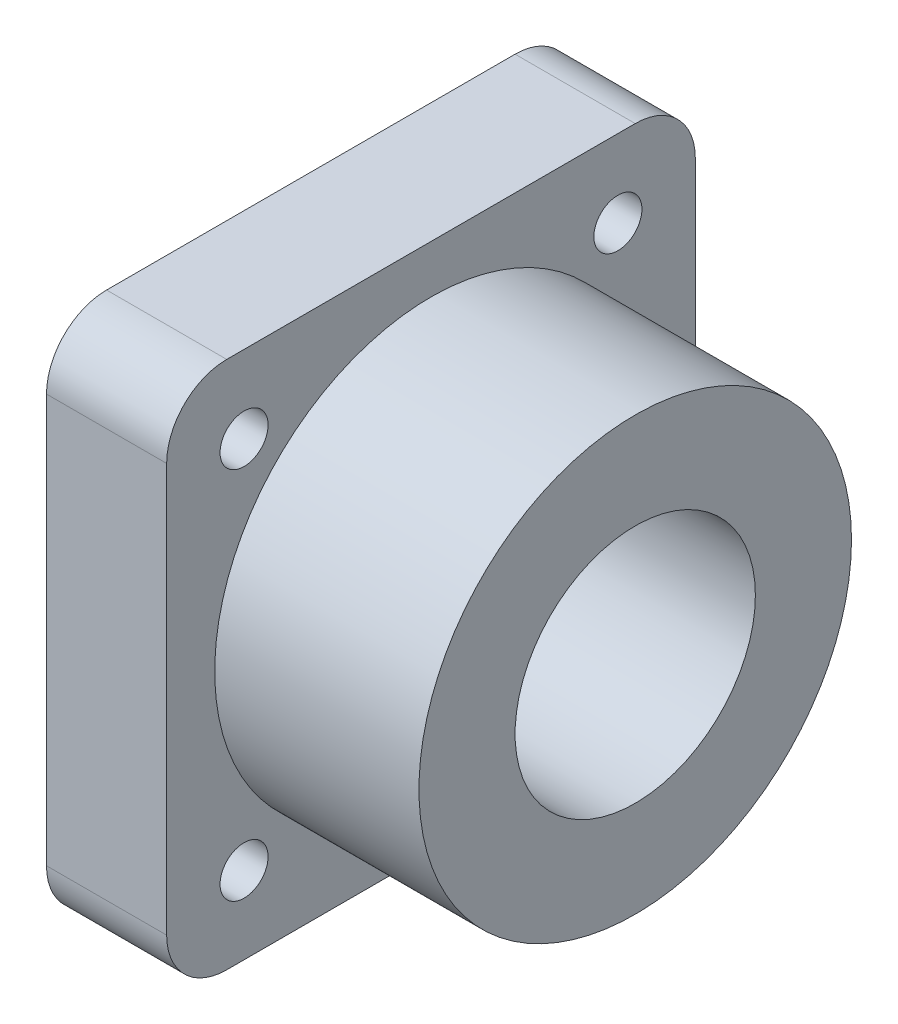
ISO-10303-21;
HEADER;
FILE_DESCRIPTION(('STEP AP214'),'2;1');
FILE_NAME('part.step','',(''),(''),'','','');
FILE_SCHEMA(('AUTOMOTIVE_DESIGN { 1 0 10303 214 1 1 1 1 }'));
ENDSEC;
DATA;
#1=APPLICATION_CONTEXT('core data for automotive mechanical design processes');
#2=APPLICATION_PROTOCOL_DEFINITION('international standard','automotive_design',2000,#1);
#3=PRODUCT_CONTEXT('',#1,'mechanical');
#4=PRODUCT('Part','Part','',(#3));
#5=PRODUCT_RELATED_PRODUCT_CATEGORY('part','',(#4));
#6=PRODUCT_DEFINITION_FORMATION('','',#4);
#7=PRODUCT_DEFINITION_CONTEXT('part definition',#1,'design');
#8=PRODUCT_DEFINITION('design','',#6,#7);
#9=PRODUCT_DEFINITION_SHAPE('','',#8);
#10=(LENGTH_UNIT() NAMED_UNIT(*) SI_UNIT(.MILLI.,.METRE.));
#11=(NAMED_UNIT(*) PLANE_ANGLE_UNIT() SI_UNIT($,.RADIAN.));
#12=(NAMED_UNIT(*) SI_UNIT($,.STERADIAN.) SOLID_ANGLE_UNIT());
#13=UNCERTAINTY_MEASURE_WITH_UNIT(LENGTH_MEASURE(1.E-05),#10,'distance_accuracy_value','');
#14=(GEOMETRIC_REPRESENTATION_CONTEXT(3) GLOBAL_UNCERTAINTY_ASSIGNED_CONTEXT((#13)) GLOBAL_UNIT_ASSIGNED_CONTEXT((#10,
#11,#12)) REPRESENTATION_CONTEXT('',''));
#15=CARTESIAN_POINT('',(0.,0.,0.));
#16=DIRECTION('',(0.,0.,1.));
#17=DIRECTION('',(1.,0.,0.));
#18=AXIS2_PLACEMENT_3D('',#15,#16,#17);
#19=CARTESIAN_POINT('',(10.,0.,0.));
#20=DIRECTION('',(1.,0.,0.));
#21=DIRECTION('',(0.,0.,-1.));
#22=AXIS2_PLACEMENT_3D('',#19,#20,#21);
#23=PLANE('',#22);
#24=CARTESIAN_POINT('',(10.,-15.556349186104,-15.556349186104));
#25=DIRECTION('',(1.,0.,0.));
#26=DIRECTION('',(0.,0.,-1.));
#27=AXIS2_PLACEMENT_3D('',#24,#25,#26);
#28=CIRCLE('',#27,2.);
#29=CARTESIAN_POINT('',(10.,-15.556349186104,-17.556349186104));
#30=VERTEX_POINT('',#29);
#31=EDGE_CURVE('E188',#30,#30,#28,.T.);
#32=ORIENTED_EDGE('',*,*,#31,.F.);
#33=EDGE_LOOP('',(#32));
#34=FACE_BOUND('',#33,.T.);
#35=CARTESIAN_POINT('',(10.,15.556349186104,15.556349186104));
#36=DIRECTION('',(1.,0.,0.));
#37=DIRECTION('',(0.,0.,-1.));
#38=AXIS2_PLACEMENT_3D('',#35,#36,#37);
#39=CIRCLE('',#38,2.);
#40=CARTESIAN_POINT('',(10.,15.556349186104,13.556349186104));
#41=VERTEX_POINT('',#40);
#42=EDGE_CURVE('E129',#41,#41,#39,.T.);
#43=ORIENTED_EDGE('',*,*,#42,.F.);
#44=EDGE_LOOP('',(#43));
#45=FACE_BOUND('',#44,.T.);
#46=DIRECTION('',(0.,0.,1.));
#47=VECTOR('',#46,1.);
#48=CARTESIAN_POINT('',(10.,22.,-22.));
#49=LINE('',#48,#47);
#50=CARTESIAN_POINT('',(10.,22.,-17.));
#51=VERTEX_POINT('',#50);
#52=CARTESIAN_POINT('',(10.,22.,17.));
#53=VERTEX_POINT('',#52);
#54=EDGE_CURVE('E138',#51,#53,#49,.T.);
#55=ORIENTED_EDGE('',*,*,#54,.T.);
#56=CARTESIAN_POINT('',(10.,17.,17.));
#57=DIRECTION('',(1.,0.,0.));
#58=DIRECTION('',(0.,0.,-1.));
#59=AXIS2_PLACEMENT_3D('',#56,#57,#58);
#60=CIRCLE('',#59,5.);
#61=CARTESIAN_POINT('',(10.,17.,22.));
#62=VERTEX_POINT('',#61);
#63=EDGE_CURVE('E157',#53,#62,#60,.T.);
#64=ORIENTED_EDGE('',*,*,#63,.T.);
#65=DIRECTION('',(0.,-1.,0.));
#66=VECTOR('',#65,1.);
#67=CARTESIAN_POINT('',(10.,-22.,22.));
#68=LINE('',#67,#66);
#69=CARTESIAN_POINT('',(10.,-17.,22.));
#70=VERTEX_POINT('',#69);
#71=EDGE_CURVE('E121',#62,#70,#68,.T.);
#72=ORIENTED_EDGE('',*,*,#71,.T.);
#73=CARTESIAN_POINT('',(10.,-17.,17.));
#74=DIRECTION('',(1.,0.,0.));
#75=DIRECTION('',(0.,0.,-1.));
#76=AXIS2_PLACEMENT_3D('',#73,#74,#75);
#77=CIRCLE('',#76,5.);
#78=CARTESIAN_POINT('',(10.,-22.,17.));
#79=VERTEX_POINT('',#78);
#80=EDGE_CURVE('E152',#70,#79,#77,.T.);
#81=ORIENTED_EDGE('',*,*,#80,.T.);
#82=DIRECTION('',(0.,0.,-1.));
#83=VECTOR('',#82,1.);
#84=CARTESIAN_POINT('',(10.,-22.,-22.));
#85=LINE('',#84,#83);
#86=CARTESIAN_POINT('',(10.,-22.,-17.));
#87=VERTEX_POINT('',#86);
#88=EDGE_CURVE('E168',#79,#87,#85,.T.);
#89=ORIENTED_EDGE('',*,*,#88,.T.);
#90=CARTESIAN_POINT('',(10.,-17.,-17.));
#91=DIRECTION('',(1.,0.,0.));
#92=DIRECTION('',(0.,0.,-1.));
#93=AXIS2_PLACEMENT_3D('',#90,#91,#92);
#94=CIRCLE('',#93,5.);
#95=CARTESIAN_POINT('',(10.,-17.,-22.));
#96=VERTEX_POINT('',#95);
#97=EDGE_CURVE('E57',#87,#96,#94,.T.);
#98=ORIENTED_EDGE('',*,*,#97,.T.);
#99=DIRECTION('',(0.,1.,0.));
#100=VECTOR('',#99,1.);
#101=CARTESIAN_POINT('',(10.,-22.,-22.));
#102=LINE('',#101,#100);
#103=CARTESIAN_POINT('',(10.,17.,-22.));
#104=VERTEX_POINT('',#103);
#105=EDGE_CURVE('E176',#96,#104,#102,.T.);
#106=ORIENTED_EDGE('',*,*,#105,.T.);
#107=CARTESIAN_POINT('',(10.,17.,-17.));
#108=DIRECTION('',(1.,0.,0.));
#109=DIRECTION('',(0.,0.,-1.));
#110=AXIS2_PLACEMENT_3D('',#107,#108,#109);
#111=CIRCLE('',#110,5.);
#112=EDGE_CURVE('E155',#104,#51,#111,.T.);
#113=ORIENTED_EDGE('',*,*,#112,.T.);
#114=EDGE_LOOP('',(#55,#64,#72,#81,#89,#98,#106,#113));
#115=FACE_BOUND('',#114,.T.);
#116=CARTESIAN_POINT('',(10.,15.556349186104,-15.556349186104));
#117=DIRECTION('',(1.,0.,0.));
#118=DIRECTION('',(0.,0.,-1.));
#119=AXIS2_PLACEMENT_3D('',#116,#117,#118);
#120=CIRCLE('',#119,2.);
#121=CARTESIAN_POINT('',(10.,15.556349186104,-17.556349186104));
#122=VERTEX_POINT('',#121);
#123=EDGE_CURVE('E183',#122,#122,#120,.T.);
#124=ORIENTED_EDGE('',*,*,#123,.F.);
#125=EDGE_LOOP('',(#124));
#126=FACE_BOUND('',#125,.T.);
#127=CARTESIAN_POINT('',(10.,-15.556349186104,15.556349186104));
#128=DIRECTION('',(1.,0.,0.));
#129=DIRECTION('',(0.,0.,-1.));
#130=AXIS2_PLACEMENT_3D('',#127,#128,#129);
#131=CIRCLE('',#130,2.);
#132=CARTESIAN_POINT('',(10.,-15.556349186104,13.556349186104));
#133=VERTEX_POINT('',#132);
#134=EDGE_CURVE('E194',#133,#133,#131,.T.);
#135=ORIENTED_EDGE('',*,*,#134,.F.);
#136=EDGE_LOOP('',(#135));
#137=FACE_BOUND('',#136,.T.);
#138=CARTESIAN_POINT('',(10.,0.,0.));
#139=DIRECTION('',(1.,0.,0.));
#140=DIRECTION('',(0.,0.,-1.));
#141=AXIS2_PLACEMENT_3D('',#138,#139,#140);
#142=CIRCLE('',#141,18.);
#143=CARTESIAN_POINT('',(10.,0.,-18.));
#144=VERTEX_POINT('',#143);
#145=EDGE_CURVE('E205',#144,#144,#142,.F.);
#146=ORIENTED_EDGE('',*,*,#145,.T.);
#147=EDGE_LOOP('',(#146));
#148=FACE_BOUND('',#147,.T.);
#149=ADVANCED_FACE('F35',(#34,#45,#115,#126,#137,#148),#23,.T.);
#150=CARTESIAN_POINT('',(0.,0.,0.));
#151=DIRECTION('',(1.,0.,0.));
#152=DIRECTION('',(0.,0.,-1.));
#153=AXIS2_PLACEMENT_3D('',#150,#151,#152);
#154=PLANE('',#153);
#155=CARTESIAN_POINT('',(0.,0.,0.));
#156=DIRECTION('',(1.,0.,0.));
#157=DIRECTION('',(0.,0.,-1.));
#158=AXIS2_PLACEMENT_3D('',#155,#156,#157);
#159=CIRCLE('',#158,10.);
#160=CARTESIAN_POINT('',(0.,0.,-10.));
#161=VERTEX_POINT('',#160);
#162=EDGE_CURVE('E200',#161,#161,#159,.T.);
#163=ORIENTED_EDGE('',*,*,#162,.T.);
#164=EDGE_LOOP('',(#163));
#165=FACE_BOUND('',#164,.T.);
#166=CARTESIAN_POINT('',(0.,-15.556349186104,-15.556349186104));
#167=DIRECTION('',(1.,0.,0.));
#168=DIRECTION('',(0.,0.,-1.));
#169=AXIS2_PLACEMENT_3D('',#166,#167,#168);
#170=CIRCLE('',#169,2.);
#171=CARTESIAN_POINT('',(0.,-15.556349186104,-17.556349186104));
#172=VERTEX_POINT('',#171);
#173=EDGE_CURVE('E191',#172,#172,#170,.T.);
#174=ORIENTED_EDGE('',*,*,#173,.T.);
#175=EDGE_LOOP('',(#174));
#176=FACE_BOUND('',#175,.T.);
#177=CARTESIAN_POINT('',(0.,15.556349186104,15.556349186104));
#178=DIRECTION('',(1.,0.,0.));
#179=DIRECTION('',(0.,0.,-1.));
#180=AXIS2_PLACEMENT_3D('',#177,#178,#179);
#181=CIRCLE('',#180,2.);
#182=CARTESIAN_POINT('',(0.,15.556349186104,13.556349186104));
#183=VERTEX_POINT('',#182);
#184=EDGE_CURVE('E135',#183,#183,#181,.T.);
#185=ORIENTED_EDGE('',*,*,#184,.T.);
#186=EDGE_LOOP('',(#185));
#187=FACE_BOUND('',#186,.T.);
#188=DIRECTION('',(0.,-1.,0.));
#189=VECTOR('',#188,1.);
#190=CARTESIAN_POINT('',(0.,-22.,22.));
#191=LINE('',#190,#189);
#192=CARTESIAN_POINT('',(0.,17.,22.));
#193=VERTEX_POINT('',#192);
#194=CARTESIAN_POINT('',(0.,-17.,22.));
#195=VERTEX_POINT('',#194);
#196=EDGE_CURVE('E118',#193,#195,#191,.T.);
#197=ORIENTED_EDGE('',*,*,#196,.F.);
#198=CARTESIAN_POINT('',(0.,17.,17.));
#199=DIRECTION('',(1.,0.,0.));
#200=DIRECTION('',(0.,0.,-1.));
#201=AXIS2_PLACEMENT_3D('',#198,#199,#200);
#202=CIRCLE('',#201,5.);
#203=CARTESIAN_POINT('',(0.,22.,17.));
#204=VERTEX_POINT('',#203);
#205=EDGE_CURVE('E101',#193,#204,#202,.F.);
#206=ORIENTED_EDGE('',*,*,#205,.T.);
#207=DIRECTION('',(0.,0.,1.));
#208=VECTOR('',#207,1.);
#209=CARTESIAN_POINT('',(0.,22.,-22.));
#210=LINE('',#209,#208);
#211=CARTESIAN_POINT('',(0.,22.,-17.));
#212=VERTEX_POINT('',#211);
#213=EDGE_CURVE('E142',#212,#204,#210,.T.);
#214=ORIENTED_EDGE('',*,*,#213,.F.);
#215=CARTESIAN_POINT('',(0.,17.,-17.));
#216=DIRECTION('',(1.,0.,0.));
#217=DIRECTION('',(0.,0.,-1.));
#218=AXIS2_PLACEMENT_3D('',#215,#216,#217);
#219=CIRCLE('',#218,5.);
#220=CARTESIAN_POINT('',(0.,17.,-22.));
#221=VERTEX_POINT('',#220);
#222=EDGE_CURVE('E112',#212,#221,#219,.F.);
#223=ORIENTED_EDGE('',*,*,#222,.T.);
#224=DIRECTION('',(0.,1.,0.));
#225=VECTOR('',#224,1.);
#226=CARTESIAN_POINT('',(0.,-22.,-22.));
#227=LINE('',#226,#225);
#228=CARTESIAN_POINT('',(0.,-17.,-22.));
#229=VERTEX_POINT('',#228);
#230=EDGE_CURVE('E132',#229,#221,#227,.T.);
#231=ORIENTED_EDGE('',*,*,#230,.F.);
#232=CARTESIAN_POINT('',(0.,-17.,-17.));
#233=DIRECTION('',(1.,0.,0.));
#234=DIRECTION('',(0.,0.,-1.));
#235=AXIS2_PLACEMENT_3D('',#232,#233,#234);
#236=CIRCLE('',#235,5.);
#237=CARTESIAN_POINT('',(0.,-22.,-17.));
#238=VERTEX_POINT('',#237);
#239=EDGE_CURVE('E146',#229,#238,#236,.F.);
#240=ORIENTED_EDGE('',*,*,#239,.T.);
#241=DIRECTION('',(0.,0.,-1.));
#242=VECTOR('',#241,1.);
#243=CARTESIAN_POINT('',(0.,-22.,-22.));
#244=LINE('',#243,#242);
#245=CARTESIAN_POINT('',(0.,-22.,17.));
#246=VERTEX_POINT('',#245);
#247=EDGE_CURVE('E128',#246,#238,#244,.T.);
#248=ORIENTED_EDGE('',*,*,#247,.F.);
#249=CARTESIAN_POINT('',(0.,-17.,17.));
#250=DIRECTION('',(1.,0.,0.));
#251=DIRECTION('',(0.,0.,-1.));
#252=AXIS2_PLACEMENT_3D('',#249,#250,#251);
#253=CIRCLE('',#252,5.);
#254=EDGE_CURVE('E122',#246,#195,#253,.F.);
#255=ORIENTED_EDGE('',*,*,#254,.T.);
#256=EDGE_LOOP('',(#197,#206,#214,#223,#231,#240,#248,#255));
#257=FACE_BOUND('',#256,.T.);
#258=CARTESIAN_POINT('',(0.,15.556349186104,-15.556349186104));
#259=DIRECTION('',(1.,0.,0.));
#260=DIRECTION('',(0.,0.,-1.));
#261=AXIS2_PLACEMENT_3D('',#258,#259,#260);
#262=CIRCLE('',#261,2.);
#263=CARTESIAN_POINT('',(0.,15.556349186104,-17.556349186104));
#264=VERTEX_POINT('',#263);
#265=EDGE_CURVE('E185',#264,#264,#262,.T.);
#266=ORIENTED_EDGE('',*,*,#265,.T.);
#267=EDGE_LOOP('',(#266));
#268=FACE_BOUND('',#267,.T.);
#269=CARTESIAN_POINT('',(0.,-15.556349186104,15.556349186104));
#270=DIRECTION('',(1.,0.,0.));
#271=DIRECTION('',(0.,0.,-1.));
#272=AXIS2_PLACEMENT_3D('',#269,#270,#271);
#273=CIRCLE('',#272,2.);
#274=CARTESIAN_POINT('',(0.,-15.556349186104,13.556349186104));
#275=VERTEX_POINT('',#274);
#276=EDGE_CURVE('E197',#275,#275,#273,.T.);
#277=ORIENTED_EDGE('',*,*,#276,.T.);
#278=EDGE_LOOP('',(#277));
#279=FACE_BOUND('',#278,.T.);
#280=ADVANCED_FACE('F125',(#165,#176,#187,#257,#268,#279),#154,.F.);
#281=CARTESIAN_POINT('',(10.,-22.,22.));
#282=DIRECTION('',(0.,0.,-1.));
#283=DIRECTION('',(0.,1.,0.));
#284=AXIS2_PLACEMENT_3D('',#281,#282,#283);
#285=PLANE('',#284);
#286=ORIENTED_EDGE('',*,*,#71,.F.);
#287=DIRECTION('',(-1.,0.,0.));
#288=VECTOR('',#287,1.);
#289=CARTESIAN_POINT('',(10.,17.,22.));
#290=LINE('',#289,#288);
#291=EDGE_CURVE('E105',#62,#193,#290,.T.);
#292=ORIENTED_EDGE('',*,*,#291,.T.);
#293=ORIENTED_EDGE('',*,*,#196,.T.);
#294=DIRECTION('',(-1.,0.,0.));
#295=VECTOR('',#294,1.);
#296=CARTESIAN_POINT('',(10.,-17.,22.));
#297=LINE('',#296,#295);
#298=EDGE_CURVE('E123',#195,#70,#297,.F.);
#299=ORIENTED_EDGE('',*,*,#298,.T.);
#300=EDGE_LOOP('',(#286,#292,#293,#299));
#301=FACE_BOUND('',#300,.T.);
#302=ADVANCED_FACE('F117',(#301),#285,.F.);
#303=CARTESIAN_POINT('',(10.,-22.,-22.));
#304=DIRECTION('',(0.,1.,0.));
#305=DIRECTION('',(0.,0.,1.));
#306=AXIS2_PLACEMENT_3D('',#303,#304,#305);
#307=PLANE('',#306);
#308=ORIENTED_EDGE('',*,*,#247,.T.);
#309=DIRECTION('',(-1.,0.,0.));
#310=VECTOR('',#309,1.);
#311=CARTESIAN_POINT('',(10.,-22.,-17.));
#312=LINE('',#311,#310);
#313=EDGE_CURVE('E11',#238,#87,#312,.F.);
#314=ORIENTED_EDGE('',*,*,#313,.T.);
#315=ORIENTED_EDGE('',*,*,#88,.F.);
#316=DIRECTION('',(-1.,0.,0.));
#317=VECTOR('',#316,1.);
#318=CARTESIAN_POINT('',(10.,-22.,17.));
#319=LINE('',#318,#317);
#320=EDGE_CURVE('E43',#79,#246,#319,.T.);
#321=ORIENTED_EDGE('',*,*,#320,.T.);
#322=EDGE_LOOP('',(#308,#314,#315,#321));
#323=FACE_BOUND('',#322,.T.);
#324=ADVANCED_FACE('F166',(#323),#307,.F.);
#325=CARTESIAN_POINT('',(10.,-22.,-22.));
#326=DIRECTION('',(0.,0.,1.));
#327=DIRECTION('',(0.,-1.,0.));
#328=AXIS2_PLACEMENT_3D('',#325,#326,#327);
#329=PLANE('',#328);
#330=ORIENTED_EDGE('',*,*,#230,.T.);
#331=DIRECTION('',(-1.,0.,0.));
#332=VECTOR('',#331,1.);
#333=CARTESIAN_POINT('',(10.,17.,-22.));
#334=LINE('',#333,#332);
#335=EDGE_CURVE('E50',#221,#104,#334,.F.);
#336=ORIENTED_EDGE('',*,*,#335,.T.);
#337=ORIENTED_EDGE('',*,*,#105,.F.);
#338=DIRECTION('',(-1.,0.,0.));
#339=VECTOR('',#338,1.);
#340=CARTESIAN_POINT('',(10.,-17.,-22.));
#341=LINE('',#340,#339);
#342=EDGE_CURVE('E159',#96,#229,#341,.T.);
#343=ORIENTED_EDGE('',*,*,#342,.T.);
#344=EDGE_LOOP('',(#330,#336,#337,#343));
#345=FACE_BOUND('',#344,.T.);
#346=ADVANCED_FACE('F175',(#345),#329,.F.);
#347=CARTESIAN_POINT('',(10.,22.,-22.));
#348=DIRECTION('',(0.,-1.,0.));
#349=DIRECTION('',(0.,0.,-1.));
#350=AXIS2_PLACEMENT_3D('',#347,#348,#349);
#351=PLANE('',#350);
#352=ORIENTED_EDGE('',*,*,#213,.T.);
#353=DIRECTION('',(-1.,0.,0.));
#354=VECTOR('',#353,1.);
#355=CARTESIAN_POINT('',(10.,22.,17.));
#356=LINE('',#355,#354);
#357=EDGE_CURVE('E106',#204,#53,#356,.F.);
#358=ORIENTED_EDGE('',*,*,#357,.T.);
#359=ORIENTED_EDGE('',*,*,#54,.F.);
#360=DIRECTION('',(-1.,0.,0.));
#361=VECTOR('',#360,1.);
#362=CARTESIAN_POINT('',(10.,22.,-17.));
#363=LINE('',#362,#361);
#364=EDGE_CURVE('E111',#51,#212,#363,.T.);
#365=ORIENTED_EDGE('',*,*,#364,.T.);
#366=EDGE_LOOP('',(#352,#358,#359,#365));
#367=FACE_BOUND('',#366,.T.);
#368=ADVANCED_FACE('F245',(#367),#351,.F.);
#369=CARTESIAN_POINT('',(10.,15.556349186104,15.556349186104));
#370=DIRECTION('',(-1.,0.,0.));
#371=DIRECTION('',(0.,0.,1.));
#372=AXIS2_PLACEMENT_3D('',#369,#370,#371);
#373=CYLINDRICAL_SURFACE('',#372,2.);
#374=ORIENTED_EDGE('',*,*,#42,.T.);
#375=EDGE_LOOP('',(#374));
#376=FACE_BOUND('',#375,.T.);
#377=ORIENTED_EDGE('',*,*,#184,.F.);
#378=EDGE_LOOP('',(#377));
#379=FACE_BOUND('',#378,.T.);
#380=ADVANCED_FACE('F242',(#376,#379),#373,.F.);
#381=CARTESIAN_POINT('',(10.,15.556349186104,-15.556349186104));
#382=DIRECTION('',(-1.,0.,0.));
#383=DIRECTION('',(0.,0.,1.));
#384=AXIS2_PLACEMENT_3D('',#381,#382,#383);
#385=CYLINDRICAL_SURFACE('',#384,2.);
#386=ORIENTED_EDGE('',*,*,#123,.T.);
#387=EDGE_LOOP('',(#386));
#388=FACE_BOUND('',#387,.T.);
#389=ORIENTED_EDGE('',*,*,#265,.F.);
#390=EDGE_LOOP('',(#389));
#391=FACE_BOUND('',#390,.T.);
#392=ADVANCED_FACE('F286',(#388,#391),#385,.F.);
#393=CARTESIAN_POINT('',(10.,-15.556349186104,-15.556349186104));
#394=DIRECTION('',(-1.,0.,0.));
#395=DIRECTION('',(0.,0.,1.));
#396=AXIS2_PLACEMENT_3D('',#393,#394,#395);
#397=CYLINDRICAL_SURFACE('',#396,2.);
#398=ORIENTED_EDGE('',*,*,#31,.T.);
#399=EDGE_LOOP('',(#398));
#400=FACE_BOUND('',#399,.T.);
#401=ORIENTED_EDGE('',*,*,#173,.F.);
#402=EDGE_LOOP('',(#401));
#403=FACE_BOUND('',#402,.T.);
#404=ADVANCED_FACE('F279',(#400,#403),#397,.F.);
#405=CARTESIAN_POINT('',(10.,-15.556349186104,15.556349186104));
#406=DIRECTION('',(-1.,0.,0.));
#407=DIRECTION('',(0.,0.,1.));
#408=AXIS2_PLACEMENT_3D('',#405,#406,#407);
#409=CYLINDRICAL_SURFACE('',#408,2.);
#410=ORIENTED_EDGE('',*,*,#134,.T.);
#411=EDGE_LOOP('',(#410));
#412=FACE_BOUND('',#411,.T.);
#413=ORIENTED_EDGE('',*,*,#276,.F.);
#414=EDGE_LOOP('',(#413));
#415=FACE_BOUND('',#414,.T.);
#416=ADVANCED_FACE('F228',(#412,#415),#409,.F.);
#417=CARTESIAN_POINT('',(10.,0.,0.));
#418=DIRECTION('',(-1.,0.,0.));
#419=DIRECTION('',(0.,0.,1.));
#420=AXIS2_PLACEMENT_3D('',#417,#418,#419);
#421=CYLINDRICAL_SURFACE('',#420,10.);
#422=ORIENTED_EDGE('',*,*,#162,.F.);
#423=EDGE_LOOP('',(#422));
#424=FACE_BOUND('',#423,.T.);
#425=CARTESIAN_POINT('',(27.,0.,0.));
#426=DIRECTION('',(1.,0.,0.));
#427=DIRECTION('',(0.,0.,-1.));
#428=AXIS2_PLACEMENT_3D('',#425,#426,#427);
#429=CIRCLE('',#428,10.);
#430=CARTESIAN_POINT('',(27.,0.,-10.));
#431=VERTEX_POINT('',#430);
#432=EDGE_CURVE('E211',#431,#431,#429,.T.);
#433=ORIENTED_EDGE('',*,*,#432,.T.);
#434=EDGE_LOOP('',(#433));
#435=FACE_BOUND('',#434,.T.);
#436=ADVANCED_FACE('F215',(#424,#435),#421,.F.);
#437=CARTESIAN_POINT('',(27.,0.,0.));
#438=DIRECTION('',(1.,0.,0.));
#439=DIRECTION('',(0.,0.,-1.));
#440=AXIS2_PLACEMENT_3D('',#437,#438,#439);
#441=PLANE('',#440);
#442=CARTESIAN_POINT('',(27.,0.,0.));
#443=DIRECTION('',(1.,0.,0.));
#444=DIRECTION('',(0.,0.,-1.));
#445=AXIS2_PLACEMENT_3D('',#442,#443,#444);
#446=CIRCLE('',#445,18.);
#447=CARTESIAN_POINT('',(27.,0.,-18.));
#448=VERTEX_POINT('',#447);
#449=EDGE_CURVE('E208',#448,#448,#446,.T.);
#450=ORIENTED_EDGE('',*,*,#449,.T.);
#451=EDGE_LOOP('',(#450));
#452=FACE_BOUND('',#451,.T.);
#453=ORIENTED_EDGE('',*,*,#432,.F.);
#454=EDGE_LOOP('',(#453));
#455=FACE_BOUND('',#454,.T.);
#456=ADVANCED_FACE('F217',(#452,#455),#441,.T.);
#457=CARTESIAN_POINT('',(27.,0.,0.));
#458=DIRECTION('',(-1.,0.,0.));
#459=DIRECTION('',(0.,0.,1.));
#460=AXIS2_PLACEMENT_3D('',#457,#458,#459);
#461=CYLINDRICAL_SURFACE('',#460,18.);
#462=ORIENTED_EDGE('',*,*,#145,.F.);
#463=EDGE_LOOP('',(#462));
#464=FACE_BOUND('',#463,.T.);
#465=ORIENTED_EDGE('',*,*,#449,.F.);
#466=EDGE_LOOP('',(#465));
#467=FACE_BOUND('',#466,.T.);
#468=ADVANCED_FACE('F219',(#464,#467),#461,.T.);
#469=CARTESIAN_POINT('',(10.,17.,17.));
#470=DIRECTION('',(-1.,0.,0.));
#471=DIRECTION('',(0.,0.,1.));
#472=AXIS2_PLACEMENT_3D('',#469,#470,#471);
#473=CYLINDRICAL_SURFACE('',#472,5.);
#474=ORIENTED_EDGE('',*,*,#63,.F.);
#475=ORIENTED_EDGE('',*,*,#357,.F.);
#476=ORIENTED_EDGE('',*,*,#205,.F.);
#477=ORIENTED_EDGE('',*,*,#291,.F.);
#478=EDGE_LOOP('',(#474,#475,#476,#477));
#479=FACE_BOUND('',#478,.T.);
#480=ADVANCED_FACE('F104',(#479),#473,.T.);
#481=CARTESIAN_POINT('',(10.,17.,-17.));
#482=DIRECTION('',(-1.,0.,0.));
#483=DIRECTION('',(0.,0.,1.));
#484=AXIS2_PLACEMENT_3D('',#481,#482,#483);
#485=CYLINDRICAL_SURFACE('',#484,5.);
#486=ORIENTED_EDGE('',*,*,#112,.F.);
#487=ORIENTED_EDGE('',*,*,#335,.F.);
#488=ORIENTED_EDGE('',*,*,#222,.F.);
#489=ORIENTED_EDGE('',*,*,#364,.F.);
#490=EDGE_LOOP('',(#486,#487,#488,#489));
#491=FACE_BOUND('',#490,.T.);
#492=ADVANCED_FACE('F257',(#491),#485,.T.);
#493=CARTESIAN_POINT('',(10.,-17.,-17.));
#494=DIRECTION('',(-1.,0.,0.));
#495=DIRECTION('',(0.,0.,1.));
#496=AXIS2_PLACEMENT_3D('',#493,#494,#495);
#497=CYLINDRICAL_SURFACE('',#496,5.);
#498=ORIENTED_EDGE('',*,*,#97,.F.);
#499=ORIENTED_EDGE('',*,*,#313,.F.);
#500=ORIENTED_EDGE('',*,*,#239,.F.);
#501=ORIENTED_EDGE('',*,*,#342,.F.);
#502=EDGE_LOOP('',(#498,#499,#500,#501));
#503=FACE_BOUND('',#502,.T.);
#504=ADVANCED_FACE('F174',(#503),#497,.T.);
#505=CARTESIAN_POINT('',(10.,-17.,17.));
#506=DIRECTION('',(-1.,0.,0.));
#507=DIRECTION('',(0.,0.,1.));
#508=AXIS2_PLACEMENT_3D('',#505,#506,#507);
#509=CYLINDRICAL_SURFACE('',#508,5.);
#510=ORIENTED_EDGE('',*,*,#80,.F.);
#511=ORIENTED_EDGE('',*,*,#298,.F.);
#512=ORIENTED_EDGE('',*,*,#254,.F.);
#513=ORIENTED_EDGE('',*,*,#320,.F.);
#514=EDGE_LOOP('',(#510,#511,#512,#513));
#515=FACE_BOUND('',#514,.T.);
#516=ADVANCED_FACE('F37',(#515),#509,.T.);
#517=CLOSED_SHELL('',(#149,#280,#302,#324,#346,#368,#380,#392,#404,#416,#436,#456,#468,#480,
#492,#504,#516));
#518=MANIFOLD_SOLID_BREP('B2',#517);
#519=ADVANCED_BREP_SHAPE_REPRESENTATION('',(#18,#518),#14);
#520=SHAPE_DEFINITION_REPRESENTATION(#9,#519);
ENDSEC;
END-ISO-10303-21;
